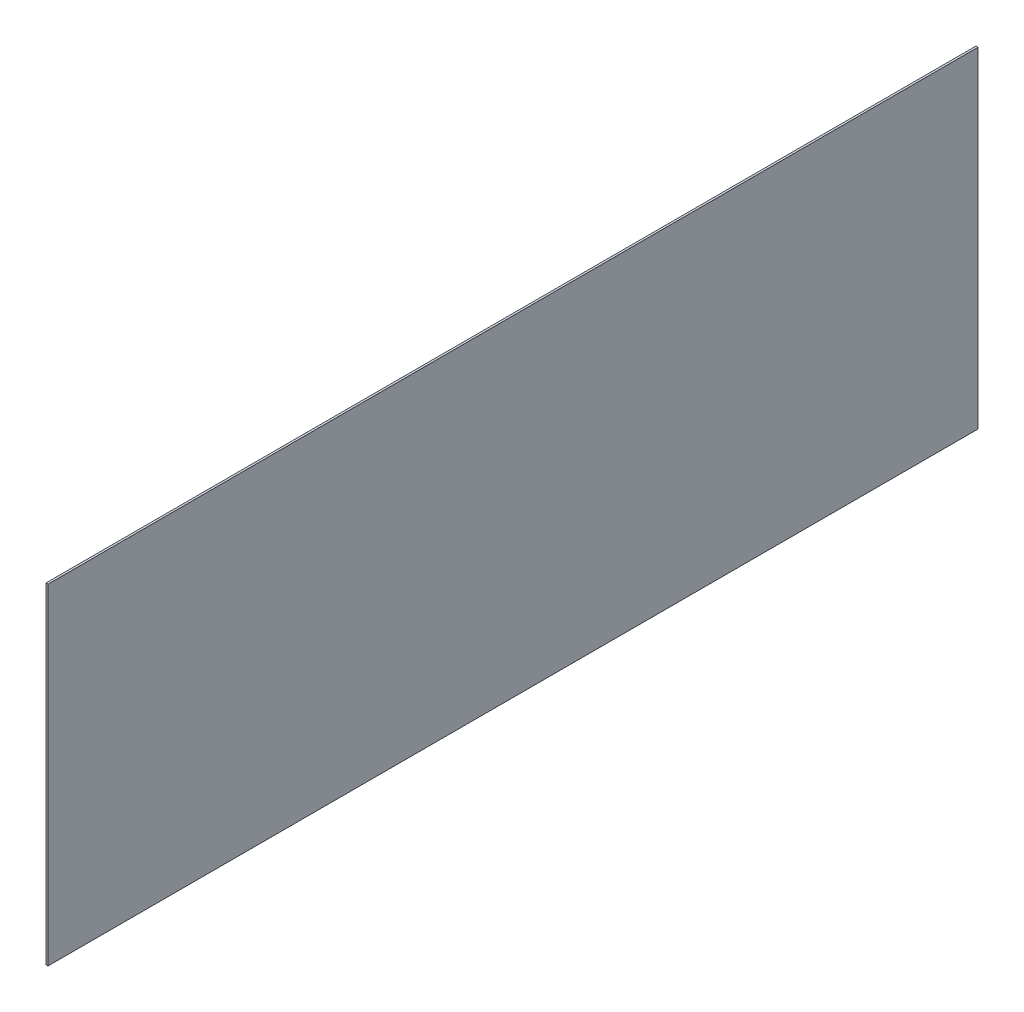
ISO-10303-21;
HEADER;
FILE_DESCRIPTION(('STEP AP214'),'2;1');
FILE_NAME('part.step','',(''),(''),'','','');
FILE_SCHEMA(('AUTOMOTIVE_DESIGN { 1 0 10303 214 1 1 1 1 }'));
ENDSEC;
DATA;
#1=APPLICATION_CONTEXT('core data for automotive mechanical design processes');
#2=APPLICATION_PROTOCOL_DEFINITION('international standard','automotive_design',2000,#1);
#3=PRODUCT_CONTEXT('',#1,'mechanical');
#4=PRODUCT('Part','Part','',(#3));
#5=PRODUCT_RELATED_PRODUCT_CATEGORY('part','',(#4));
#6=PRODUCT_DEFINITION_FORMATION('','',#4);
#7=PRODUCT_DEFINITION_CONTEXT('part definition',#1,'design');
#8=PRODUCT_DEFINITION('design','',#6,#7);
#9=PRODUCT_DEFINITION_SHAPE('','',#8);
#10=(LENGTH_UNIT() NAMED_UNIT(*) SI_UNIT(.MILLI.,.METRE.));
#11=(NAMED_UNIT(*) PLANE_ANGLE_UNIT() SI_UNIT($,.RADIAN.));
#12=(NAMED_UNIT(*) SI_UNIT($,.STERADIAN.) SOLID_ANGLE_UNIT());
#13=UNCERTAINTY_MEASURE_WITH_UNIT(LENGTH_MEASURE(1.E-05),#10,'distance_accuracy_value','');
#14=(GEOMETRIC_REPRESENTATION_CONTEXT(3) GLOBAL_UNCERTAINTY_ASSIGNED_CONTEXT((#13)) GLOBAL_UNIT_ASSIGNED_CONTEXT((#10,
#11,#12)) REPRESENTATION_CONTEXT('',''));
#15=CARTESIAN_POINT('',(0.,0.,0.));
#16=DIRECTION('',(0.,0.,1.));
#17=DIRECTION('',(1.,0.,0.));
#18=AXIS2_PLACEMENT_3D('',#15,#16,#17);
#19=CARTESIAN_POINT('',(1.,80.,-225.));
#20=DIRECTION('',(0.,0.,1.));
#21=DIRECTION('',(1.,0.,0.));
#22=AXIS2_PLACEMENT_3D('',#19,#20,#21);
#23=PLANE('',#22);
#24=DIRECTION('',(0.,1.,0.));
#25=VECTOR('',#24,1.);
#26=CARTESIAN_POINT('',(0.,80.,-225.));
#27=LINE('',#26,#25);
#28=CARTESIAN_POINT('',(0.,-80.,-225.));
#29=VERTEX_POINT('',#28);
#30=CARTESIAN_POINT('',(0.,80.,-225.));
#31=VERTEX_POINT('',#30);
#32=EDGE_CURVE('E95',#29,#31,#27,.T.);
#33=ORIENTED_EDGE('',*,*,#32,.T.);
#34=DIRECTION('',(-1.,0.,0.));
#35=VECTOR('',#34,1.);
#36=CARTESIAN_POINT('',(1.,80.,-225.));
#37=LINE('',#36,#35);
#38=CARTESIAN_POINT('',(1.,80.,-225.));
#39=VERTEX_POINT('',#38);
#40=EDGE_CURVE('E11',#39,#31,#37,.T.);
#41=ORIENTED_EDGE('',*,*,#40,.F.);
#42=DIRECTION('',(0.,1.,0.));
#43=VECTOR('',#42,1.);
#44=CARTESIAN_POINT('',(1.,80.,-225.));
#45=LINE('',#44,#43);
#46=CARTESIAN_POINT('',(1.,-80.,-225.));
#47=VERTEX_POINT('',#46);
#48=EDGE_CURVE('E83',#47,#39,#45,.T.);
#49=ORIENTED_EDGE('',*,*,#48,.F.);
#50=DIRECTION('',(-1.,0.,0.));
#51=VECTOR('',#50,1.);
#52=CARTESIAN_POINT('',(1.,-80.,-225.));
#53=LINE('',#52,#51);
#54=EDGE_CURVE('E91',#47,#29,#53,.T.);
#55=ORIENTED_EDGE('',*,*,#54,.T.);
#56=EDGE_LOOP('',(#33,#41,#49,#55));
#57=FACE_BOUND('',#56,.T.);
#58=ADVANCED_FACE('F32',(#57),#23,.F.);
#59=CARTESIAN_POINT('',(1.,80.,225.));
#60=DIRECTION('',(0.,-1.,0.));
#61=DIRECTION('',(0.,0.,-1.));
#62=AXIS2_PLACEMENT_3D('',#59,#60,#61);
#63=PLANE('',#62);
#64=DIRECTION('',(0.,0.,1.));
#65=VECTOR('',#64,1.);
#66=CARTESIAN_POINT('',(0.,80.,225.));
#67=LINE('',#66,#65);
#68=CARTESIAN_POINT('',(0.,80.,225.));
#69=VERTEX_POINT('',#68);
#70=EDGE_CURVE('E87',#31,#69,#67,.T.);
#71=ORIENTED_EDGE('',*,*,#70,.T.);
#72=DIRECTION('',(-1.,0.,0.));
#73=VECTOR('',#72,1.);
#74=CARTESIAN_POINT('',(1.,80.,225.));
#75=LINE('',#74,#73);
#76=CARTESIAN_POINT('',(1.,80.,225.));
#77=VERTEX_POINT('',#76);
#78=EDGE_CURVE('E40',#77,#69,#75,.T.);
#79=ORIENTED_EDGE('',*,*,#78,.F.);
#80=DIRECTION('',(0.,0.,1.));
#81=VECTOR('',#80,1.);
#82=CARTESIAN_POINT('',(1.,80.,225.));
#83=LINE('',#82,#81);
#84=EDGE_CURVE('E78',#39,#77,#83,.T.);
#85=ORIENTED_EDGE('',*,*,#84,.F.);
#86=ORIENTED_EDGE('',*,*,#40,.T.);
#87=EDGE_LOOP('',(#71,#79,#85,#86));
#88=FACE_BOUND('',#87,.T.);
#89=ADVANCED_FACE('F86',(#88),#63,.F.);
#90=CARTESIAN_POINT('',(1.,80.,225.));
#91=DIRECTION('',(0.,0.,-1.));
#92=DIRECTION('',(-1.,0.,0.));
#93=AXIS2_PLACEMENT_3D('',#90,#91,#92);
#94=PLANE('',#93);
#95=DIRECTION('',(0.,-1.,0.));
#96=VECTOR('',#95,1.);
#97=CARTESIAN_POINT('',(0.,80.,225.));
#98=LINE('',#97,#96);
#99=CARTESIAN_POINT('',(0.,-80.,225.));
#100=VERTEX_POINT('',#99);
#101=EDGE_CURVE('E65',#69,#100,#98,.T.);
#102=ORIENTED_EDGE('',*,*,#101,.T.);
#103=DIRECTION('',(-1.,0.,0.));
#104=VECTOR('',#103,1.);
#105=CARTESIAN_POINT('',(1.,-80.,225.));
#106=LINE('',#105,#104);
#107=CARTESIAN_POINT('',(1.,-80.,225.));
#108=VERTEX_POINT('',#107);
#109=EDGE_CURVE('E88',#108,#100,#106,.T.);
#110=ORIENTED_EDGE('',*,*,#109,.F.);
#111=DIRECTION('',(0.,-1.,0.));
#112=VECTOR('',#111,1.);
#113=CARTESIAN_POINT('',(1.,80.,225.));
#114=LINE('',#113,#112);
#115=EDGE_CURVE('E81',#77,#108,#114,.T.);
#116=ORIENTED_EDGE('',*,*,#115,.F.);
#117=ORIENTED_EDGE('',*,*,#78,.T.);
#118=EDGE_LOOP('',(#102,#110,#116,#117));
#119=FACE_BOUND('',#118,.T.);
#120=ADVANCED_FACE('F89',(#119),#94,.F.);
#121=CARTESIAN_POINT('',(1.,-80.,225.));
#122=DIRECTION('',(0.,1.,0.));
#123=DIRECTION('',(0.,0.,1.));
#124=AXIS2_PLACEMENT_3D('',#121,#122,#123);
#125=PLANE('',#124);
#126=DIRECTION('',(0.,0.,-1.));
#127=VECTOR('',#126,1.);
#128=CARTESIAN_POINT('',(0.,-80.,225.));
#129=LINE('',#128,#127);
#130=EDGE_CURVE('E71',#100,#29,#129,.T.);
#131=ORIENTED_EDGE('',*,*,#130,.T.);
#132=ORIENTED_EDGE('',*,*,#54,.F.);
#133=DIRECTION('',(0.,0.,-1.));
#134=VECTOR('',#133,1.);
#135=CARTESIAN_POINT('',(1.,-80.,225.));
#136=LINE('',#135,#134);
#137=EDGE_CURVE('E48',#108,#47,#136,.T.);
#138=ORIENTED_EDGE('',*,*,#137,.F.);
#139=ORIENTED_EDGE('',*,*,#109,.T.);
#140=EDGE_LOOP('',(#131,#132,#138,#139));
#141=FACE_BOUND('',#140,.T.);
#142=ADVANCED_FACE('F102',(#141),#125,.F.);
#143=CARTESIAN_POINT('',(1.,0.,0.));
#144=DIRECTION('',(1.,0.,0.));
#145=DIRECTION('',(0.,0.,-1.));
#146=AXIS2_PLACEMENT_3D('',#143,#144,#145);
#147=PLANE('',#146);
#148=ORIENTED_EDGE('',*,*,#48,.T.);
#149=ORIENTED_EDGE('',*,*,#84,.T.);
#150=ORIENTED_EDGE('',*,*,#115,.T.);
#151=ORIENTED_EDGE('',*,*,#137,.T.);
#152=EDGE_LOOP('',(#148,#149,#150,#151));
#153=FACE_BOUND('',#152,.T.);
#154=ADVANCED_FACE('F79',(#153),#147,.T.);
#155=CARTESIAN_POINT('',(0.,0.,0.));
#156=DIRECTION('',(1.,0.,0.));
#157=DIRECTION('',(0.,0.,-1.));
#158=AXIS2_PLACEMENT_3D('',#155,#156,#157);
#159=PLANE('',#158);
#160=ORIENTED_EDGE('',*,*,#32,.F.);
#161=ORIENTED_EDGE('',*,*,#130,.F.);
#162=ORIENTED_EDGE('',*,*,#101,.F.);
#163=ORIENTED_EDGE('',*,*,#70,.F.);
#164=EDGE_LOOP('',(#160,#161,#162,#163));
#165=FACE_BOUND('',#164,.T.);
#166=ADVANCED_FACE('F105',(#165),#159,.F.);
#167=CLOSED_SHELL('',(#58,#89,#120,#142,#154,#166));
#168=MANIFOLD_SOLID_BREP('B2',#167);
#169=ADVANCED_BREP_SHAPE_REPRESENTATION('',(#18,#168),#14);
#170=SHAPE_DEFINITION_REPRESENTATION(#9,#169);
ENDSEC;
END-ISO-10303-21;
